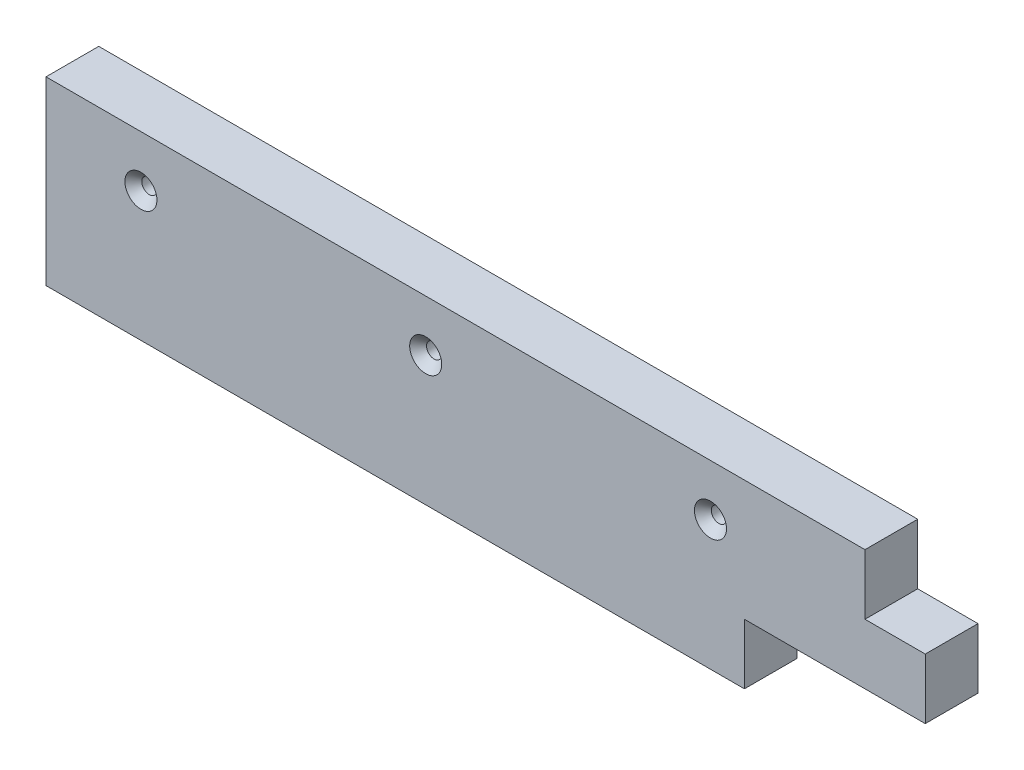
ISO-10303-21;
HEADER;
FILE_DESCRIPTION(('STEP AP214'),'2;1');
FILE_NAME('part.step','',(''),(''),'','','');
FILE_SCHEMA(('AUTOMOTIVE_DESIGN { 1 0 10303 214 1 1 1 1 }'));
ENDSEC;
DATA;
#1=APPLICATION_CONTEXT('core data for automotive mechanical design processes');
#2=APPLICATION_PROTOCOL_DEFINITION('international standard','automotive_design',2000,#1);
#3=PRODUCT_CONTEXT('',#1,'mechanical');
#4=PRODUCT('Part','Part','',(#3));
#5=PRODUCT_RELATED_PRODUCT_CATEGORY('part','',(#4));
#6=PRODUCT_DEFINITION_FORMATION('','',#4);
#7=PRODUCT_DEFINITION_CONTEXT('part definition',#1,'design');
#8=PRODUCT_DEFINITION('design','',#6,#7);
#9=PRODUCT_DEFINITION_SHAPE('','',#8);
#10=(LENGTH_UNIT() NAMED_UNIT(*) SI_UNIT(.MILLI.,.METRE.));
#11=(NAMED_UNIT(*) PLANE_ANGLE_UNIT() SI_UNIT($,.RADIAN.));
#12=(NAMED_UNIT(*) SI_UNIT($,.STERADIAN.) SOLID_ANGLE_UNIT());
#13=UNCERTAINTY_MEASURE_WITH_UNIT(LENGTH_MEASURE(1.E-05),#10,'distance_accuracy_value','');
#14=(GEOMETRIC_REPRESENTATION_CONTEXT(3) GLOBAL_UNCERTAINTY_ASSIGNED_CONTEXT((#13)) GLOBAL_UNIT_ASSIGNED_CONTEXT((#10,
#11,#12)) REPRESENTATION_CONTEXT('',''));
#15=CARTESIAN_POINT('',(0.,0.,0.));
#16=DIRECTION('',(0.,0.,1.));
#17=DIRECTION('',(1.,0.,0.));
#18=AXIS2_PLACEMENT_3D('',#15,#16,#17);
#19=CARTESIAN_POINT('',(-185.25206409,38.1,11.1125));
#20=DIRECTION('',(-1.,0.,0.));
#21=DIRECTION('',(0.,0.,1.));
#22=AXIS2_PLACEMENT_3D('',#19,#20,#21);
#23=PLANE('',#22);
#24=DIRECTION('',(0.,0.,-1.));
#25=VECTOR('',#24,1.);
#26=CARTESIAN_POINT('',(-185.25206409,-38.1,11.1125));
#27=LINE('',#26,#25);
#28=CARTESIAN_POINT('',(-185.25206409,-38.1,11.1125));
#29=VERTEX_POINT('',#28);
#30=CARTESIAN_POINT('',(-185.25206409,-38.1,-11.1125));
#31=VERTEX_POINT('',#30);
#32=EDGE_CURVE('E119',#29,#31,#27,.T.);
#33=ORIENTED_EDGE('',*,*,#32,.F.);
#34=DIRECTION('',(0.,-1.,0.));
#35=VECTOR('',#34,1.);
#36=CARTESIAN_POINT('',(-185.25206409,38.1,11.1125));
#37=LINE('',#36,#35);
#38=CARTESIAN_POINT('',(-185.25206409,38.1,11.1125));
#39=VERTEX_POINT('',#38);
#40=EDGE_CURVE('E11',#39,#29,#37,.T.);
#41=ORIENTED_EDGE('',*,*,#40,.F.);
#42=DIRECTION('',(0.,0.,-1.));
#43=VECTOR('',#42,1.);
#44=CARTESIAN_POINT('',(-185.25206409,38.1,11.1125));
#45=LINE('',#44,#43);
#46=CARTESIAN_POINT('',(-185.25206409,38.1,-11.1125));
#47=VERTEX_POINT('',#46);
#48=EDGE_CURVE('E122',#39,#47,#45,.T.);
#49=ORIENTED_EDGE('',*,*,#48,.T.);
#50=DIRECTION('',(0.,-1.,0.));
#51=VECTOR('',#50,1.);
#52=CARTESIAN_POINT('',(-185.25206409,38.1,-11.1125));
#53=LINE('',#52,#51);
#54=EDGE_CURVE('E36',#47,#31,#53,.T.);
#55=ORIENTED_EDGE('',*,*,#54,.T.);
#56=EDGE_LOOP('',(#33,#41,#49,#55));
#57=FACE_BOUND('',#56,.T.);
#58=ADVANCED_FACE('F33',(#57),#23,.T.);
#59=CARTESIAN_POINT('',(-185.25206409,38.1,11.1125));
#60=DIRECTION('',(0.,0.,-1.));
#61=DIRECTION('',(-1.,0.,0.));
#62=AXIS2_PLACEMENT_3D('',#59,#60,#61);
#63=PLANE('',#62);
#64=CARTESIAN_POINT('',(-145.252063960531,16.5074600000015,11.1125));
#65=DIRECTION('',(0.,0.,1.));
#66=DIRECTION('',(1.,0.,0.));
#67=AXIS2_PLACEMENT_3D('',#64,#65,#66);
#68=CIRCLE('',#67,6.75000000000001);
#69=CARTESIAN_POINT('',(-138.502063960531,16.5074600000015,11.1125));
#70=VERTEX_POINT('',#69);
#71=EDGE_CURVE('E167',#70,#70,#68,.T.);
#72=ORIENTED_EDGE('',*,*,#71,.F.);
#73=EDGE_LOOP('',(#72));
#74=FACE_BOUND('',#73,.T.);
#75=CARTESIAN_POINT('',(-25.2520639605315,16.5074599999999,11.1125));
#76=DIRECTION('',(0.,0.,1.));
#77=DIRECTION('',(1.,0.,0.));
#78=AXIS2_PLACEMENT_3D('',#75,#76,#77);
#79=CIRCLE('',#78,6.75);
#80=CARTESIAN_POINT('',(-18.5020639605315,16.5074599999999,11.1125));
#81=VERTEX_POINT('',#80);
#82=EDGE_CURVE('E158',#81,#81,#79,.T.);
#83=ORIENTED_EDGE('',*,*,#82,.F.);
#84=EDGE_LOOP('',(#83));
#85=FACE_BOUND('',#84,.T.);
#86=CARTESIAN_POINT('',(94.7479360394685,16.5074599999982,11.1125));
#87=DIRECTION('',(0.,0.,1.));
#88=DIRECTION('',(1.,0.,0.));
#89=AXIS2_PLACEMENT_3D('',#86,#87,#88);
#90=CIRCLE('',#89,6.75000000000001);
#91=CARTESIAN_POINT('',(101.497936039469,16.5074599999982,11.1125));
#92=VERTEX_POINT('',#91);
#93=EDGE_CURVE('E149',#92,#92,#90,.T.);
#94=ORIENTED_EDGE('',*,*,#93,.F.);
#95=EDGE_LOOP('',(#94));
#96=FACE_BOUND('',#95,.T.);
#97=DIRECTION('',(1.,0.,0.));
#98=VECTOR('',#97,1.);
#99=CARTESIAN_POINT('',(-185.25206409,-38.1,11.1125));
#100=LINE('',#99,#98);
#101=CARTESIAN_POINT('',(109.05206409,-38.1,11.1125));
#102=VERTEX_POINT('',#101);
#103=EDGE_CURVE('E120',#29,#102,#100,.T.);
#104=ORIENTED_EDGE('',*,*,#103,.T.);
#105=DIRECTION('',(0.,-1.,0.));
#106=VECTOR('',#105,1.);
#107=CARTESIAN_POINT('',(109.05206409,-12.7,11.1125));
#108=LINE('',#107,#106);
#109=CARTESIAN_POINT('',(109.05206409,-12.7,11.1125));
#110=VERTEX_POINT('',#109);
#111=EDGE_CURVE('E49',#110,#102,#108,.T.);
#112=ORIENTED_EDGE('',*,*,#111,.F.);
#113=DIRECTION('',(-1.,0.,0.));
#114=VECTOR('',#113,1.);
#115=CARTESIAN_POINT('',(109.05206409,-12.7,11.1125));
#116=LINE('',#115,#114);
#117=CARTESIAN_POINT('',(185.25206409,-12.7,11.1125));
#118=VERTEX_POINT('',#117);
#119=EDGE_CURVE('E115',#118,#110,#116,.T.);
#120=ORIENTED_EDGE('',*,*,#119,.F.);
#121=DIRECTION('',(0.,-1.,0.));
#122=VECTOR('',#121,1.);
#123=CARTESIAN_POINT('',(185.25206409,38.1,11.1125));
#124=LINE('',#123,#122);
#125=CARTESIAN_POINT('',(185.25206409,12.7,11.1125));
#126=VERTEX_POINT('',#125);
#127=EDGE_CURVE('E41',#126,#118,#124,.T.);
#128=ORIENTED_EDGE('',*,*,#127,.F.);
#129=DIRECTION('',(1.,0.,0.));
#130=VECTOR('',#129,1.);
#131=CARTESIAN_POINT('',(185.25206409,12.7,11.1125));
#132=LINE('',#131,#130);
#133=CARTESIAN_POINT('',(159.85206409,12.7,11.1125));
#134=VERTEX_POINT('',#133);
#135=EDGE_CURVE('E178',#134,#126,#132,.T.);
#136=ORIENTED_EDGE('',*,*,#135,.F.);
#137=DIRECTION('',(0.,-1.,0.));
#138=VECTOR('',#137,1.);
#139=CARTESIAN_POINT('',(159.85206409,38.1,11.1125));
#140=LINE('',#139,#138);
#141=CARTESIAN_POINT('',(159.85206409,38.1,11.1125));
#142=VERTEX_POINT('',#141);
#143=EDGE_CURVE('E180',#142,#134,#140,.T.);
#144=ORIENTED_EDGE('',*,*,#143,.F.);
#145=DIRECTION('',(1.,0.,0.));
#146=VECTOR('',#145,1.);
#147=CARTESIAN_POINT('',(-185.25206409,38.1,11.1125));
#148=LINE('',#147,#146);
#149=EDGE_CURVE('E132',#39,#142,#148,.T.);
#150=ORIENTED_EDGE('',*,*,#149,.F.);
#151=ORIENTED_EDGE('',*,*,#40,.T.);
#152=EDGE_LOOP('',(#104,#112,#120,#128,#136,#144,#150,#151));
#153=FACE_BOUND('',#152,.T.);
#154=ADVANCED_FACE('F197',(#74,#85,#96,#153),#63,.F.);
#155=CARTESIAN_POINT('',(185.25206409,38.1,11.1125));
#156=DIRECTION('',(-1.,0.,0.));
#157=DIRECTION('',(0.,0.,1.));
#158=AXIS2_PLACEMENT_3D('',#155,#156,#157);
#159=PLANE('',#158);
#160=ORIENTED_EDGE('',*,*,#127,.T.);
#161=DIRECTION('',(0.,0.,1.));
#162=VECTOR('',#161,1.);
#163=CARTESIAN_POINT('',(185.25206409,-12.7,-11.1125));
#164=LINE('',#163,#162);
#165=CARTESIAN_POINT('',(185.25206409,-12.7,-11.1125));
#166=VERTEX_POINT('',#165);
#167=EDGE_CURVE('E105',#166,#118,#164,.T.);
#168=ORIENTED_EDGE('',*,*,#167,.F.);
#169=DIRECTION('',(0.,-1.,0.));
#170=VECTOR('',#169,1.);
#171=CARTESIAN_POINT('',(185.25206409,38.1,-11.1125));
#172=LINE('',#171,#170);
#173=CARTESIAN_POINT('',(185.25206409,12.7,-11.1125));
#174=VERTEX_POINT('',#173);
#175=EDGE_CURVE('E129',#174,#166,#172,.T.);
#176=ORIENTED_EDGE('',*,*,#175,.F.);
#177=DIRECTION('',(0.,0.,1.));
#178=VECTOR('',#177,1.);
#179=CARTESIAN_POINT('',(185.25206409,12.7,-11.1125));
#180=LINE('',#179,#178);
#181=EDGE_CURVE('E170',#174,#126,#180,.T.);
#182=ORIENTED_EDGE('',*,*,#181,.T.);
#183=EDGE_LOOP('',(#160,#168,#176,#182));
#184=FACE_BOUND('',#183,.T.);
#185=ADVANCED_FACE('F205',(#184),#159,.F.);
#186=CARTESIAN_POINT('',(-185.25206409,38.1,-11.1125));
#187=DIRECTION('',(0.,0.,-1.));
#188=DIRECTION('',(-1.,0.,0.));
#189=AXIS2_PLACEMENT_3D('',#186,#187,#188);
#190=PLANE('',#189);
#191=DIRECTION('',(0.,-1.,0.));
#192=VECTOR('',#191,1.);
#193=CARTESIAN_POINT('',(109.05206409,-12.7,-11.1125));
#194=LINE('',#193,#192);
#195=CARTESIAN_POINT('',(109.05206409,-12.7,-11.1125));
#196=VERTEX_POINT('',#195);
#197=CARTESIAN_POINT('',(109.05206409,-38.1,-11.1125));
#198=VERTEX_POINT('',#197);
#199=EDGE_CURVE('E99',#196,#198,#194,.T.);
#200=ORIENTED_EDGE('',*,*,#199,.T.);
#201=DIRECTION('',(1.,0.,0.));
#202=VECTOR('',#201,1.);
#203=CARTESIAN_POINT('',(-185.25206409,-38.1,-11.1125));
#204=LINE('',#203,#202);
#205=EDGE_CURVE('E112',#31,#198,#204,.T.);
#206=ORIENTED_EDGE('',*,*,#205,.F.);
#207=ORIENTED_EDGE('',*,*,#54,.F.);
#208=DIRECTION('',(1.,0.,0.));
#209=VECTOR('',#208,1.);
#210=CARTESIAN_POINT('',(-185.25206409,38.1,-11.1125));
#211=LINE('',#210,#209);
#212=CARTESIAN_POINT('',(159.85206409,38.1,-11.1125));
#213=VERTEX_POINT('',#212);
#214=EDGE_CURVE('E136',#47,#213,#211,.T.);
#215=ORIENTED_EDGE('',*,*,#214,.T.);
#216=DIRECTION('',(0.,-1.,0.));
#217=VECTOR('',#216,1.);
#218=CARTESIAN_POINT('',(159.85206409,38.1,-11.1125));
#219=LINE('',#218,#217);
#220=CARTESIAN_POINT('',(159.85206409,12.7,-11.1125));
#221=VERTEX_POINT('',#220);
#222=EDGE_CURVE('E57',#213,#221,#219,.T.);
#223=ORIENTED_EDGE('',*,*,#222,.T.);
#224=DIRECTION('',(1.,0.,0.));
#225=VECTOR('',#224,1.);
#226=CARTESIAN_POINT('',(185.25206409,12.7,-11.1125));
#227=LINE('',#226,#225);
#228=EDGE_CURVE('E174',#221,#174,#227,.T.);
#229=ORIENTED_EDGE('',*,*,#228,.T.);
#230=ORIENTED_EDGE('',*,*,#175,.T.);
#231=DIRECTION('',(-1.,0.,0.));
#232=VECTOR('',#231,1.);
#233=CARTESIAN_POINT('',(109.05206409,-12.7,-11.1125));
#234=LINE('',#233,#232);
#235=EDGE_CURVE('E106',#166,#196,#234,.T.);
#236=ORIENTED_EDGE('',*,*,#235,.T.);
#237=EDGE_LOOP('',(#200,#206,#207,#215,#223,#229,#230,#236));
#238=FACE_BOUND('',#237,.T.);
#239=CARTESIAN_POINT('',(-145.252063960531,16.5074600000015,-11.1125));
#240=DIRECTION('',(0.,0.,1.));
#241=DIRECTION('',(1.,0.,0.));
#242=AXIS2_PLACEMENT_3D('',#239,#240,#241);
#243=CIRCLE('',#242,3.20000000000001);
#244=CARTESIAN_POINT('',(-142.052063960531,16.5074600000015,-11.1125));
#245=VERTEX_POINT('',#244);
#246=EDGE_CURVE('E161',#245,#245,#243,.T.);
#247=ORIENTED_EDGE('',*,*,#246,.T.);
#248=EDGE_LOOP('',(#247));
#249=FACE_BOUND('',#248,.T.);
#250=CARTESIAN_POINT('',(-25.2520639605315,16.5074599999999,-11.1125));
#251=DIRECTION('',(0.,0.,1.));
#252=DIRECTION('',(1.,0.,0.));
#253=AXIS2_PLACEMENT_3D('',#250,#251,#252);
#254=CIRCLE('',#253,3.19999999999999);
#255=CARTESIAN_POINT('',(-22.0520639605315,16.5074599999999,-11.1125));
#256=VERTEX_POINT('',#255);
#257=EDGE_CURVE('E152',#256,#256,#254,.T.);
#258=ORIENTED_EDGE('',*,*,#257,.T.);
#259=EDGE_LOOP('',(#258));
#260=FACE_BOUND('',#259,.T.);
#261=CARTESIAN_POINT('',(94.7479360394685,16.5074599999982,-11.1125));
#262=DIRECTION('',(0.,0.,1.));
#263=DIRECTION('',(1.,0.,0.));
#264=AXIS2_PLACEMENT_3D('',#261,#262,#263);
#265=CIRCLE('',#264,3.19999999999999);
#266=CARTESIAN_POINT('',(97.9479360394685,16.5074599999982,-11.1125));
#267=VERTEX_POINT('',#266);
#268=EDGE_CURVE('E124',#267,#267,#265,.T.);
#269=ORIENTED_EDGE('',*,*,#268,.T.);
#270=EDGE_LOOP('',(#269));
#271=FACE_BOUND('',#270,.T.);
#272=ADVANCED_FACE('F110',(#238,#249,#260,#271),#190,.T.);
#273=CARTESIAN_POINT('',(0.,38.1,0.));
#274=DIRECTION('',(0.,-1.,0.));
#275=DIRECTION('',(0.,0.,-1.));
#276=AXIS2_PLACEMENT_3D('',#273,#274,#275);
#277=PLANE('',#276);
#278=ORIENTED_EDGE('',*,*,#149,.T.);
#279=DIRECTION('',(0.,0.,1.));
#280=VECTOR('',#279,1.);
#281=CARTESIAN_POINT('',(159.85206409,38.1,-11.1125));
#282=LINE('',#281,#280);
#283=EDGE_CURVE('E171',#213,#142,#282,.T.);
#284=ORIENTED_EDGE('',*,*,#283,.F.);
#285=ORIENTED_EDGE('',*,*,#214,.F.);
#286=ORIENTED_EDGE('',*,*,#48,.F.);
#287=EDGE_LOOP('',(#278,#284,#285,#286));
#288=FACE_BOUND('',#287,.T.);
#289=ADVANCED_FACE('F201',(#288),#277,.F.);
#290=CARTESIAN_POINT('',(0.,-38.1,0.));
#291=DIRECTION('',(0.,-1.,0.));
#292=DIRECTION('',(0.,0.,-1.));
#293=AXIS2_PLACEMENT_3D('',#290,#291,#292);
#294=PLANE('',#293);
#295=DIRECTION('',(0.,0.,1.));
#296=VECTOR('',#295,1.);
#297=CARTESIAN_POINT('',(109.05206409,-38.1,-11.1125));
#298=LINE('',#297,#296);
#299=EDGE_CURVE('E96',#198,#102,#298,.T.);
#300=ORIENTED_EDGE('',*,*,#299,.T.);
#301=ORIENTED_EDGE('',*,*,#103,.F.);
#302=ORIENTED_EDGE('',*,*,#32,.T.);
#303=ORIENTED_EDGE('',*,*,#205,.T.);
#304=EDGE_LOOP('',(#300,#301,#302,#303));
#305=FACE_BOUND('',#304,.T.);
#306=ADVANCED_FACE('F117',(#305),#294,.T.);
#307=CARTESIAN_POINT('',(94.7479360394685,16.5074599999982,11.1125));
#308=DIRECTION('',(0.,0.,1.));
#309=DIRECTION('',(1.,0.,0.));
#310=AXIS2_PLACEMENT_3D('',#307,#308,#309);
#311=CYLINDRICAL_SURFACE('',#310,3.19999999999999);
#312=ORIENTED_EDGE('',*,*,#268,.F.);
#313=EDGE_LOOP('',(#312));
#314=FACE_BOUND('',#313,.T.);
#315=CARTESIAN_POINT('',(94.7479360394685,16.5074599999982,7.56250000000002));
#316=DIRECTION('',(0.,0.,1.));
#317=DIRECTION('',(1.,0.,0.));
#318=AXIS2_PLACEMENT_3D('',#315,#316,#317);
#319=CIRCLE('',#318,3.19999999999998);
#320=CARTESIAN_POINT('',(97.9479360394685,16.5074599999982,7.56250000000002));
#321=VERTEX_POINT('',#320);
#322=EDGE_CURVE('E146',#321,#321,#319,.T.);
#323=ORIENTED_EDGE('',*,*,#322,.T.);
#324=EDGE_LOOP('',(#323));
#325=FACE_BOUND('',#324,.T.);
#326=ADVANCED_FACE('F239',(#314,#325),#311,.F.);
#327=CARTESIAN_POINT('',(94.7479360394685,16.5074599999982,11.1125));
#328=DIRECTION('',(0.,0.,1.));
#329=DIRECTION('',(1.,0.,0.));
#330=AXIS2_PLACEMENT_3D('',#327,#328,#329);
#331=CONICAL_SURFACE('',#330,6.75000000000001,0.785398163397454);
#332=ORIENTED_EDGE('',*,*,#322,.F.);
#333=EDGE_LOOP('',(#332));
#334=FACE_BOUND('',#333,.T.);
#335=ORIENTED_EDGE('',*,*,#93,.T.);
#336=EDGE_LOOP('',(#335));
#337=FACE_BOUND('',#336,.T.);
#338=ADVANCED_FACE('F243',(#334,#337),#331,.F.);
#339=CARTESIAN_POINT('',(-25.2520639605315,16.5074599999999,11.1125));
#340=DIRECTION('',(0.,0.,1.));
#341=DIRECTION('',(1.,0.,0.));
#342=AXIS2_PLACEMENT_3D('',#339,#340,#341);
#343=CYLINDRICAL_SURFACE('',#342,3.19999999999999);
#344=ORIENTED_EDGE('',*,*,#257,.F.);
#345=EDGE_LOOP('',(#344));
#346=FACE_BOUND('',#345,.T.);
#347=CARTESIAN_POINT('',(-25.2520639605315,16.5074599999999,7.56250000000002));
#348=DIRECTION('',(0.,0.,1.));
#349=DIRECTION('',(1.,0.,0.));
#350=AXIS2_PLACEMENT_3D('',#347,#348,#349);
#351=CIRCLE('',#350,3.19999999999999);
#352=CARTESIAN_POINT('',(-22.0520639605315,16.5074599999999,7.56250000000002));
#353=VERTEX_POINT('',#352);
#354=EDGE_CURVE('E155',#353,#353,#351,.T.);
#355=ORIENTED_EDGE('',*,*,#354,.T.);
#356=EDGE_LOOP('',(#355));
#357=FACE_BOUND('',#356,.T.);
#358=ADVANCED_FACE('F247',(#346,#357),#343,.F.);
#359=CARTESIAN_POINT('',(-25.2520639605315,16.5074599999999,11.1125));
#360=DIRECTION('',(0.,0.,1.));
#361=DIRECTION('',(1.,0.,0.));
#362=AXIS2_PLACEMENT_3D('',#359,#360,#361);
#363=CONICAL_SURFACE('',#362,6.75,0.785398163397452);
#364=ORIENTED_EDGE('',*,*,#354,.F.);
#365=EDGE_LOOP('',(#364));
#366=FACE_BOUND('',#365,.T.);
#367=ORIENTED_EDGE('',*,*,#82,.T.);
#368=EDGE_LOOP('',(#367));
#369=FACE_BOUND('',#368,.T.);
#370=ADVANCED_FACE('F251',(#366,#369),#363,.F.);
#371=CARTESIAN_POINT('',(-145.252063960531,16.5074600000015,11.1125));
#372=DIRECTION('',(0.,0.,1.));
#373=DIRECTION('',(1.,0.,0.));
#374=AXIS2_PLACEMENT_3D('',#371,#372,#373);
#375=CYLINDRICAL_SURFACE('',#374,3.19999999999999);
#376=ORIENTED_EDGE('',*,*,#246,.F.);
#377=EDGE_LOOP('',(#376));
#378=FACE_BOUND('',#377,.T.);
#379=CARTESIAN_POINT('',(-145.252063960531,16.5074600000015,7.56250000000002));
#380=DIRECTION('',(0.,0.,1.));
#381=DIRECTION('',(1.,0.,0.));
#382=AXIS2_PLACEMENT_3D('',#379,#380,#381);
#383=CIRCLE('',#382,3.19999999999998);
#384=CARTESIAN_POINT('',(-142.052063960531,16.5074600000015,7.56250000000002));
#385=VERTEX_POINT('',#384);
#386=EDGE_CURVE('E164',#385,#385,#383,.T.);
#387=ORIENTED_EDGE('',*,*,#386,.T.);
#388=EDGE_LOOP('',(#387));
#389=FACE_BOUND('',#388,.T.);
#390=ADVANCED_FACE('F255',(#378,#389),#375,.F.);
#391=CARTESIAN_POINT('',(-145.252063960531,16.5074600000015,11.1125));
#392=DIRECTION('',(0.,0.,1.));
#393=DIRECTION('',(1.,0.,0.));
#394=AXIS2_PLACEMENT_3D('',#391,#392,#393);
#395=CONICAL_SURFACE('',#394,6.75000000000001,0.785398163397454);
#396=ORIENTED_EDGE('',*,*,#386,.F.);
#397=EDGE_LOOP('',(#396));
#398=FACE_BOUND('',#397,.T.);
#399=ORIENTED_EDGE('',*,*,#71,.T.);
#400=EDGE_LOOP('',(#399));
#401=FACE_BOUND('',#400,.T.);
#402=ADVANCED_FACE('F215',(#398,#401),#395,.F.);
#403=CARTESIAN_POINT('',(185.25206409,12.7,-11.1125));
#404=DIRECTION('',(0.,-1.,0.));
#405=DIRECTION('',(0.,0.,-1.));
#406=AXIS2_PLACEMENT_3D('',#403,#404,#405);
#407=PLANE('',#406);
#408=ORIENTED_EDGE('',*,*,#135,.T.);
#409=ORIENTED_EDGE('',*,*,#181,.F.);
#410=ORIENTED_EDGE('',*,*,#228,.F.);
#411=DIRECTION('',(0.,0.,1.));
#412=VECTOR('',#411,1.);
#413=CARTESIAN_POINT('',(159.85206409,12.7,-11.1125));
#414=LINE('',#413,#412);
#415=EDGE_CURVE('E173',#221,#134,#414,.T.);
#416=ORIENTED_EDGE('',*,*,#415,.T.);
#417=EDGE_LOOP('',(#408,#409,#410,#416));
#418=FACE_BOUND('',#417,.T.);
#419=ADVANCED_FACE('F206',(#418),#407,.F.);
#420=CARTESIAN_POINT('',(159.85206409,38.1,-11.1125));
#421=DIRECTION('',(-1.,0.,0.));
#422=DIRECTION('',(0.,0.,1.));
#423=AXIS2_PLACEMENT_3D('',#420,#421,#422);
#424=PLANE('',#423);
#425=ORIENTED_EDGE('',*,*,#143,.T.);
#426=ORIENTED_EDGE('',*,*,#415,.F.);
#427=ORIENTED_EDGE('',*,*,#222,.F.);
#428=ORIENTED_EDGE('',*,*,#283,.T.);
#429=EDGE_LOOP('',(#425,#426,#427,#428));
#430=FACE_BOUND('',#429,.T.);
#431=ADVANCED_FACE('F207',(#430),#424,.F.);
#432=CARTESIAN_POINT('',(109.05206409,-12.7,-11.1125));
#433=DIRECTION('',(-1.,0.,0.));
#434=DIRECTION('',(0.,0.,1.));
#435=AXIS2_PLACEMENT_3D('',#432,#433,#434);
#436=PLANE('',#435);
#437=ORIENTED_EDGE('',*,*,#111,.T.);
#438=ORIENTED_EDGE('',*,*,#299,.F.);
#439=ORIENTED_EDGE('',*,*,#199,.F.);
#440=DIRECTION('',(0.,0.,1.));
#441=VECTOR('',#440,1.);
#442=CARTESIAN_POINT('',(109.05206409,-12.7,-11.1125));
#443=LINE('',#442,#441);
#444=EDGE_CURVE('E183',#196,#110,#443,.T.);
#445=ORIENTED_EDGE('',*,*,#444,.T.);
#446=EDGE_LOOP('',(#437,#438,#439,#445));
#447=FACE_BOUND('',#446,.T.);
#448=ADVANCED_FACE('F98',(#447),#436,.F.);
#449=CARTESIAN_POINT('',(109.05206409,-12.7,-11.1125));
#450=DIRECTION('',(0.,1.,0.));
#451=DIRECTION('',(0.,0.,1.));
#452=AXIS2_PLACEMENT_3D('',#449,#450,#451);
#453=PLANE('',#452);
#454=ORIENTED_EDGE('',*,*,#119,.T.);
#455=ORIENTED_EDGE('',*,*,#444,.F.);
#456=ORIENTED_EDGE('',*,*,#235,.F.);
#457=ORIENTED_EDGE('',*,*,#167,.T.);
#458=EDGE_LOOP('',(#454,#455,#456,#457));
#459=FACE_BOUND('',#458,.T.);
#460=ADVANCED_FACE('F193',(#459),#453,.F.);
#461=CLOSED_SHELL('',(#58,#154,#185,#272,#289,#306,#326,#338,#358,#370,#390,#402,#419,#431,#448,#460));
#462=MANIFOLD_SOLID_BREP('B2',#461);
#463=ADVANCED_BREP_SHAPE_REPRESENTATION('',(#18,#462),#14);
#464=SHAPE_DEFINITION_REPRESENTATION(#9,#463);
ENDSEC;
END-ISO-10303-21;
